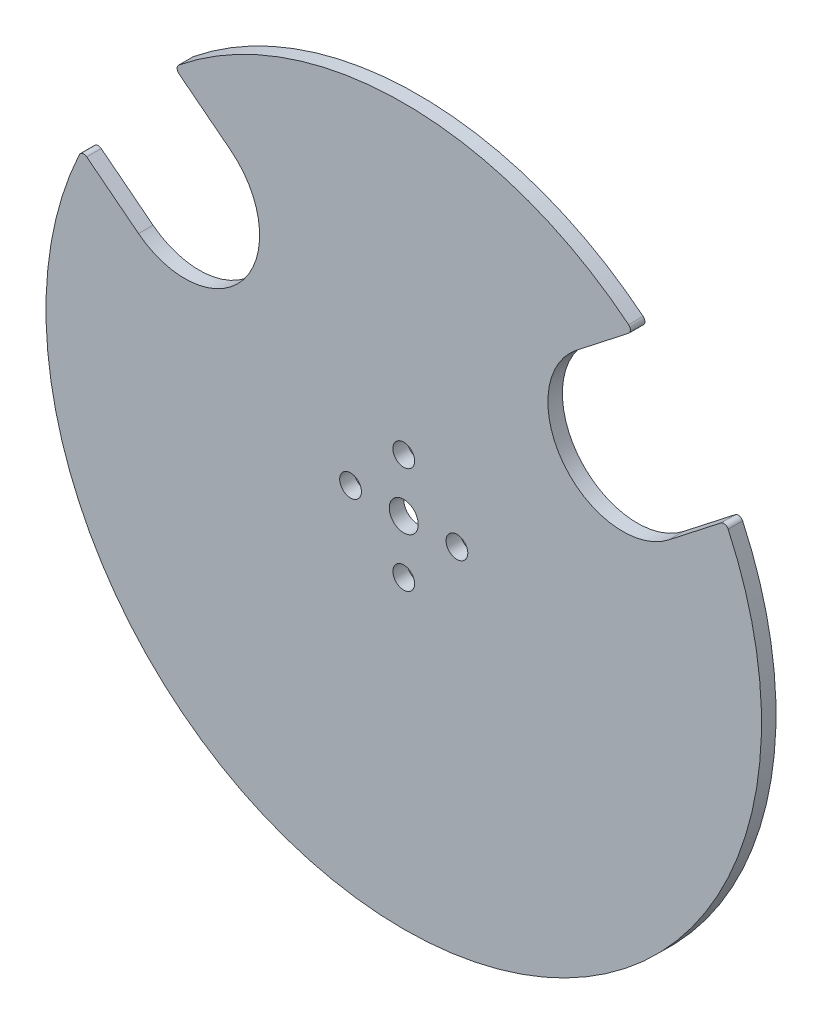
ISO-10303-21;
HEADER;
FILE_DESCRIPTION(('STEP AP214'),'2;1');
FILE_NAME('part.step','',(''),(''),'','','');
FILE_SCHEMA(('AUTOMOTIVE_DESIGN { 1 0 10303 214 1 1 1 1 }'));
ENDSEC;
DATA;
#1=APPLICATION_CONTEXT('core data for automotive mechanical design processes');
#2=APPLICATION_PROTOCOL_DEFINITION('international standard','automotive_design',2000,#1);
#3=PRODUCT_CONTEXT('',#1,'mechanical');
#4=PRODUCT('Part','Part','',(#3));
#5=PRODUCT_RELATED_PRODUCT_CATEGORY('part','',(#4));
#6=PRODUCT_DEFINITION_FORMATION('','',#4);
#7=PRODUCT_DEFINITION_CONTEXT('part definition',#1,'design');
#8=PRODUCT_DEFINITION('design','',#6,#7);
#9=PRODUCT_DEFINITION_SHAPE('','',#8);
#10=(LENGTH_UNIT() NAMED_UNIT(*) SI_UNIT(.MILLI.,.METRE.));
#11=(NAMED_UNIT(*) PLANE_ANGLE_UNIT() SI_UNIT($,.RADIAN.));
#12=(NAMED_UNIT(*) SI_UNIT($,.STERADIAN.) SOLID_ANGLE_UNIT());
#13=UNCERTAINTY_MEASURE_WITH_UNIT(LENGTH_MEASURE(1.E-05),#10,'distance_accuracy_value','');
#14=(GEOMETRIC_REPRESENTATION_CONTEXT(3) GLOBAL_UNCERTAINTY_ASSIGNED_CONTEXT((#13)) GLOBAL_UNIT_ASSIGNED_CONTEXT((#10,
#11,#12)) REPRESENTATION_CONTEXT('',''));
#15=CARTESIAN_POINT('',(0.,0.,0.));
#16=DIRECTION('',(0.,0.,1.));
#17=DIRECTION('',(1.,0.,0.));
#18=AXIS2_PLACEMENT_3D('',#15,#16,#17);
#19=CARTESIAN_POINT('',(0.,0.,3.));
#20=DIRECTION('',(0.,0.,1.));
#21=DIRECTION('',(1.,0.,0.));
#22=AXIS2_PLACEMENT_3D('',#19,#20,#21);
#23=PLANE('',#22);
#24=CARTESIAN_POINT('',(-11.,0.,3.));
#25=DIRECTION('',(0.,0.,1.));
#26=DIRECTION('',(1.,0.,0.));
#27=AXIS2_PLACEMENT_3D('',#24,#25,#26);
#28=CIRCLE('',#27,2.25);
#29=CARTESIAN_POINT('',(-8.75,0.,3.));
#30=VERTEX_POINT('',#29);
#31=EDGE_CURVE('E350',#30,#30,#28,.T.);
#32=ORIENTED_EDGE('',*,*,#31,.F.);
#33=EDGE_LOOP('',(#32));
#34=FACE_BOUND('',#33,.T.);
#35=CARTESIAN_POINT('',(11.,0.,3.));
#36=DIRECTION('',(0.,0.,1.));
#37=DIRECTION('',(1.,0.,0.));
#38=AXIS2_PLACEMENT_3D('',#35,#36,#37);
#39=CIRCLE('',#38,2.25);
#40=CARTESIAN_POINT('',(13.25,0.,3.));
#41=VERTEX_POINT('',#40);
#42=EDGE_CURVE('E366',#41,#41,#39,.T.);
#43=ORIENTED_EDGE('',*,*,#42,.F.);
#44=EDGE_LOOP('',(#43));
#45=FACE_BOUND('',#44,.T.);
#46=DIRECTION('',(0.788010753606723,0.615661475325657,0.));
#47=VECTOR('',#46,1.);
#48=CARTESIAN_POINT('',(47.4765095131863,56.7624968129867,3.));
#49=LINE('',#48,#47);
#50=CARTESIAN_POINT('',(35.7678654648389,47.6147015121295,3.));
#51=VERTEX_POINT('',#50);
#52=CARTESIAN_POINT('',(46.4933450764279,55.9943645700547,3.));
#53=VERTEX_POINT('',#52);
#54=EDGE_CURVE('E162',#51,#53,#49,.T.);
#55=ORIENTED_EDGE('',*,*,#54,.T.);
#56=CARTESIAN_POINT('',(45.8776836011022,56.7823753236614,3.));
#57=DIRECTION('',(0.,0.,1.));
#58=DIRECTION('',(1.,0.,0.));
#59=AXIS2_PLACEMENT_3D('',#56,#57,#58);
#60=CIRCLE('',#59,1.);
#61=CARTESIAN_POINT('',(46.5061450202954,57.5602160815198,3.));
#62=VERTEX_POINT('',#61);
#63=EDGE_CURVE('E245',#53,#62,#60,.T.);
#64=ORIENTED_EDGE('',*,*,#63,.T.);
#65=CARTESIAN_POINT('',(0.,0.,3.));
#66=DIRECTION('',(0.,0.,1.));
#67=DIRECTION('',(1.,0.,0.));
#68=AXIS2_PLACEMENT_3D('',#65,#66,#67);
#69=CIRCLE('',#68,74.);
#70=CARTESIAN_POINT('',(-46.5061450202954,57.5602160815198,3.));
#71=VERTEX_POINT('',#70);
#72=EDGE_CURVE('E165',#62,#71,#69,.T.);
#73=ORIENTED_EDGE('',*,*,#72,.T.);
#74=CARTESIAN_POINT('',(-45.8776836011022,56.7823753236614,3.));
#75=DIRECTION('',(0.,0.,1.));
#76=DIRECTION('',(1.,0.,0.));
#77=AXIS2_PLACEMENT_3D('',#74,#75,#76);
#78=CIRCLE('',#77,1.);
#79=CARTESIAN_POINT('',(-46.4933450764279,55.9943645700547,3.));
#80=VERTEX_POINT('',#79);
#81=EDGE_CURVE('E64',#71,#80,#78,.T.);
#82=ORIENTED_EDGE('',*,*,#81,.T.);
#83=DIRECTION('',(0.788010753606723,-0.615661475325657,0.));
#84=VECTOR('',#83,1.);
#85=CARTESIAN_POINT('',(-47.4765095131863,56.7624968129867,3.));
#86=LINE('',#85,#84);
#87=CARTESIAN_POINT('',(-35.7678654648389,47.6147015121295,3.));
#88=VERTEX_POINT('',#87);
#89=EDGE_CURVE('E171',#80,#88,#86,.T.);
#90=ORIENTED_EDGE('',*,*,#89,.T.);
#91=CARTESIAN_POINT('',(-45.3106183323866,35.4005348312252,3.));
#92=DIRECTION('',(0.,0.,-1.));
#93=DIRECTION('',(1.,0.,0.));
#94=AXIS2_PLACEMENT_3D('',#91,#92,#93);
#95=CIRCLE('',#94,15.5);
#96=CARTESIAN_POINT('',(-54.8533711999343,23.186368150321,3.));
#97=VERTEX_POINT('',#96);
#98=EDGE_CURVE('E174',#88,#97,#95,.T.);
#99=ORIENTED_EDGE('',*,*,#98,.T.);
#100=DIRECTION('',(-0.788010753606722,0.615661475325658,0.));
#101=VECTOR('',#100,1.);
#102=CARTESIAN_POINT('',(-66.5620152482817,32.3341634511783,3.));
#103=LINE('',#102,#101);
#104=CARTESIAN_POINT('',(-65.5788508115232,31.5660312082463,3.));
#105=VERTEX_POINT('',#104);
#106=EDGE_CURVE('E177',#97,#105,#103,.T.);
#107=ORIENTED_EDGE('',*,*,#106,.T.);
#108=CARTESIAN_POINT('',(-66.1945122868489,30.7780204546396,3.));
#109=DIRECTION('',(0.,0.,1.));
#110=DIRECTION('',(1.,0.,0.));
#111=AXIS2_PLACEMENT_3D('',#108,#109,#110);
#112=CIRCLE('',#111,1.);
#113=CARTESIAN_POINT('',(-67.1012864277646,31.1996371731963,3.));
#114=VERTEX_POINT('',#113);
#115=EDGE_CURVE('E240',#105,#114,#112,.T.);
#116=ORIENTED_EDGE('',*,*,#115,.T.);
#117=CARTESIAN_POINT('',(0.,0.,3.));
#118=DIRECTION('',(0.,0.,1.));
#119=DIRECTION('',(1.,0.,0.));
#120=AXIS2_PLACEMENT_3D('',#117,#118,#119);
#121=CIRCLE('',#120,74.);
#122=CARTESIAN_POINT('',(67.1012864277646,31.1996371731963,3.));
#123=VERTEX_POINT('',#122);
#124=EDGE_CURVE('E145',#114,#123,#121,.T.);
#125=ORIENTED_EDGE('',*,*,#124,.T.);
#126=CARTESIAN_POINT('',(66.1945122868489,30.7780204546396,3.));
#127=DIRECTION('',(0.,0.,1.));
#128=DIRECTION('',(1.,0.,0.));
#129=AXIS2_PLACEMENT_3D('',#126,#127,#128);
#130=CIRCLE('',#129,1.);
#131=CARTESIAN_POINT('',(65.5788508115232,31.5660312082463,3.));
#132=VERTEX_POINT('',#131);
#133=EDGE_CURVE('E140',#123,#132,#130,.T.);
#134=ORIENTED_EDGE('',*,*,#133,.T.);
#135=DIRECTION('',(-0.788010753606722,-0.615661475325658,0.));
#136=VECTOR('',#135,1.);
#137=CARTESIAN_POINT('',(66.5620152482817,32.3341634511783,3.));
#138=LINE('',#137,#136);
#139=CARTESIAN_POINT('',(54.8533711999343,23.186368150321,3.));
#140=VERTEX_POINT('',#139);
#141=EDGE_CURVE('E131',#132,#140,#138,.T.);
#142=ORIENTED_EDGE('',*,*,#141,.T.);
#143=CARTESIAN_POINT('',(45.3106183323866,35.4005348312252,3.));
#144=DIRECTION('',(0.,0.,-1.));
#145=DIRECTION('',(-1.,0.,0.));
#146=AXIS2_PLACEMENT_3D('',#143,#144,#145);
#147=CIRCLE('',#146,15.5);
#148=EDGE_CURVE('E136',#140,#51,#147,.T.);
#149=ORIENTED_EDGE('',*,*,#148,.T.);
#150=EDGE_LOOP('',(#55,#64,#73,#82,#90,#99,#107,#116,#125,#134,#142,#149));
#151=FACE_BOUND('',#150,.T.);
#152=CARTESIAN_POINT('',(0.,11.,3.));
#153=DIRECTION('',(0.,0.,1.));
#154=DIRECTION('',(1.,0.,0.));
#155=AXIS2_PLACEMENT_3D('',#152,#153,#154);
#156=CIRCLE('',#155,2.25);
#157=CARTESIAN_POINT('',(2.25,11.,3.));
#158=VERTEX_POINT('',#157);
#159=EDGE_CURVE('E185',#158,#158,#156,.T.);
#160=ORIENTED_EDGE('',*,*,#159,.F.);
#161=EDGE_LOOP('',(#160));
#162=FACE_BOUND('',#161,.T.);
#163=CARTESIAN_POINT('',(0.,-11.,3.));
#164=DIRECTION('',(0.,0.,1.));
#165=DIRECTION('',(1.,0.,0.));
#166=AXIS2_PLACEMENT_3D('',#163,#164,#165);
#167=CIRCLE('',#166,2.25);
#168=CARTESIAN_POINT('',(2.25,-11.,3.));
#169=VERTEX_POINT('',#168);
#170=EDGE_CURVE('E358',#169,#169,#167,.T.);
#171=ORIENTED_EDGE('',*,*,#170,.F.);
#172=EDGE_LOOP('',(#171));
#173=FACE_BOUND('',#172,.T.);
#174=CARTESIAN_POINT('',(0.,0.,3.));
#175=DIRECTION('',(0.,0.,1.));
#176=DIRECTION('',(1.,0.,0.));
#177=AXIS2_PLACEMENT_3D('',#174,#175,#176);
#178=CIRCLE('',#177,3.);
#179=CARTESIAN_POINT('',(3.,0.,3.));
#180=VERTEX_POINT('',#179);
#181=EDGE_CURVE('E339',#180,#180,#178,.T.);
#182=ORIENTED_EDGE('',*,*,#181,.F.);
#183=EDGE_LOOP('',(#182));
#184=FACE_BOUND('',#183,.T.);
#185=ADVANCED_FACE('F41',(#34,#45,#151,#162,#173,#184),#23,.T.);
#186=CARTESIAN_POINT('',(0.,0.,0.));
#187=DIRECTION('',(0.,0.,1.));
#188=DIRECTION('',(1.,0.,0.));
#189=AXIS2_PLACEMENT_3D('',#186,#187,#188);
#190=PLANE('',#189);
#191=CARTESIAN_POINT('',(0.,0.,0.));
#192=DIRECTION('',(0.,0.,1.));
#193=DIRECTION('',(1.,0.,0.));
#194=AXIS2_PLACEMENT_3D('',#191,#192,#193);
#195=CIRCLE('',#194,74.);
#196=CARTESIAN_POINT('',(46.5061450202954,57.5602160815198,0.));
#197=VERTEX_POINT('',#196);
#198=CARTESIAN_POINT('',(-46.5061450202954,57.5602160815198,0.));
#199=VERTEX_POINT('',#198);
#200=EDGE_CURVE('E195',#197,#199,#195,.T.);
#201=ORIENTED_EDGE('',*,*,#200,.F.);
#202=CARTESIAN_POINT('',(45.8776836011022,56.7823753236614,0.));
#203=DIRECTION('',(0.,0.,1.));
#204=DIRECTION('',(1.,0.,0.));
#205=AXIS2_PLACEMENT_3D('',#202,#203,#204);
#206=CIRCLE('',#205,1.);
#207=CARTESIAN_POINT('',(46.4933450764279,55.9943645700547,0.));
#208=VERTEX_POINT('',#207);
#209=EDGE_CURVE('E232',#197,#208,#206,.F.);
#210=ORIENTED_EDGE('',*,*,#209,.T.);
#211=DIRECTION('',(0.788010753606723,0.615661475325657,0.));
#212=VECTOR('',#211,1.);
#213=CARTESIAN_POINT('',(47.4765095131863,56.7624968129867,0.));
#214=LINE('',#213,#212);
#215=CARTESIAN_POINT('',(35.7678654648389,47.6147015121295,0.));
#216=VERTEX_POINT('',#215);
#217=EDGE_CURVE('E191',#216,#208,#214,.T.);
#218=ORIENTED_EDGE('',*,*,#217,.F.);
#219=CARTESIAN_POINT('',(45.3106183323866,35.4005348312252,0.));
#220=DIRECTION('',(0.,0.,-1.));
#221=DIRECTION('',(-1.,0.,0.));
#222=AXIS2_PLACEMENT_3D('',#219,#220,#221);
#223=CIRCLE('',#222,15.5);
#224=CARTESIAN_POINT('',(54.8533711999343,23.186368150321,0.));
#225=VERTEX_POINT('',#224);
#226=EDGE_CURVE('E188',#225,#216,#223,.T.);
#227=ORIENTED_EDGE('',*,*,#226,.F.);
#228=DIRECTION('',(-0.788010753606722,-0.615661475325658,0.));
#229=VECTOR('',#228,1.);
#230=CARTESIAN_POINT('',(66.5620152482817,32.3341634511783,0.));
#231=LINE('',#230,#229);
#232=CARTESIAN_POINT('',(65.5788508115232,31.5660312082463,0.));
#233=VERTEX_POINT('',#232);
#234=EDGE_CURVE('E151',#233,#225,#231,.T.);
#235=ORIENTED_EDGE('',*,*,#234,.F.);
#236=CARTESIAN_POINT('',(66.1945122868489,30.7780204546396,0.));
#237=DIRECTION('',(0.,0.,1.));
#238=DIRECTION('',(1.,0.,0.));
#239=AXIS2_PLACEMENT_3D('',#236,#237,#238);
#240=CIRCLE('',#239,1.);
#241=CARTESIAN_POINT('',(67.1012864277646,31.1996371731963,0.));
#242=VERTEX_POINT('',#241);
#243=EDGE_CURVE('E229',#233,#242,#240,.F.);
#244=ORIENTED_EDGE('',*,*,#243,.T.);
#245=CARTESIAN_POINT('',(0.,0.,0.));
#246=DIRECTION('',(0.,0.,1.));
#247=DIRECTION('',(1.,0.,0.));
#248=AXIS2_PLACEMENT_3D('',#245,#246,#247);
#249=CIRCLE('',#248,74.);
#250=CARTESIAN_POINT('',(-67.1012864277646,31.1996371731963,0.));
#251=VERTEX_POINT('',#250);
#252=EDGE_CURVE('E181',#251,#242,#249,.T.);
#253=ORIENTED_EDGE('',*,*,#252,.F.);
#254=CARTESIAN_POINT('',(-66.1945122868489,30.7780204546396,0.));
#255=DIRECTION('',(0.,0.,1.));
#256=DIRECTION('',(1.,0.,0.));
#257=AXIS2_PLACEMENT_3D('',#254,#255,#256);
#258=CIRCLE('',#257,1.);
#259=CARTESIAN_POINT('',(-65.5788508115232,31.5660312082463,0.));
#260=VERTEX_POINT('',#259);
#261=EDGE_CURVE('E226',#251,#260,#258,.F.);
#262=ORIENTED_EDGE('',*,*,#261,.T.);
#263=DIRECTION('',(-0.788010753606722,0.615661475325658,0.));
#264=VECTOR('',#263,1.);
#265=CARTESIAN_POINT('',(-66.5620152482817,32.3341634511783,0.));
#266=LINE('',#265,#264);
#267=CARTESIAN_POINT('',(-54.8533711999343,23.186368150321,0.));
#268=VERTEX_POINT('',#267);
#269=EDGE_CURVE('E205',#268,#260,#266,.T.);
#270=ORIENTED_EDGE('',*,*,#269,.F.);
#271=CARTESIAN_POINT('',(-45.3106183323866,35.4005348312252,0.));
#272=DIRECTION('',(0.,0.,-1.));
#273=DIRECTION('',(1.,0.,0.));
#274=AXIS2_PLACEMENT_3D('',#271,#272,#273);
#275=CIRCLE('',#274,15.5);
#276=CARTESIAN_POINT('',(-35.7678654648389,47.6147015121295,0.));
#277=VERTEX_POINT('',#276);
#278=EDGE_CURVE('E202',#277,#268,#275,.T.);
#279=ORIENTED_EDGE('',*,*,#278,.F.);
#280=DIRECTION('',(0.788010753606723,-0.615661475325657,0.));
#281=VECTOR('',#280,1.);
#282=CARTESIAN_POINT('',(-47.4765095131863,56.7624968129867,0.));
#283=LINE('',#282,#281);
#284=CARTESIAN_POINT('',(-46.4933450764279,55.9943645700547,0.));
#285=VERTEX_POINT('',#284);
#286=EDGE_CURVE('E199',#285,#277,#283,.T.);
#287=ORIENTED_EDGE('',*,*,#286,.F.);
#288=CARTESIAN_POINT('',(-45.8776836011022,56.7823753236614,0.));
#289=DIRECTION('',(0.,0.,1.));
#290=DIRECTION('',(1.,0.,0.));
#291=AXIS2_PLACEMENT_3D('',#288,#289,#290);
#292=CIRCLE('',#291,1.);
#293=EDGE_CURVE('E223',#285,#199,#292,.F.);
#294=ORIENTED_EDGE('',*,*,#293,.T.);
#295=EDGE_LOOP('',(#201,#210,#218,#227,#235,#244,#253,#262,#270,#279,#287,#294));
#296=FACE_BOUND('',#295,.T.);
#297=CARTESIAN_POINT('',(0.,11.,0.));
#298=DIRECTION('',(0.,0.,1.));
#299=DIRECTION('',(1.,0.,0.));
#300=AXIS2_PLACEMENT_3D('',#297,#298,#299);
#301=CIRCLE('',#300,2.25);
#302=CARTESIAN_POINT('',(2.25,11.,0.));
#303=VERTEX_POINT('',#302);
#304=EDGE_CURVE('E370',#303,#303,#301,.T.);
#305=ORIENTED_EDGE('',*,*,#304,.T.);
#306=EDGE_LOOP('',(#305));
#307=FACE_BOUND('',#306,.T.);
#308=CARTESIAN_POINT('',(11.,0.,0.));
#309=DIRECTION('',(0.,0.,1.));
#310=DIRECTION('',(1.,0.,0.));
#311=AXIS2_PLACEMENT_3D('',#308,#309,#310);
#312=CIRCLE('',#311,2.25);
#313=CARTESIAN_POINT('',(13.25,0.,0.));
#314=VERTEX_POINT('',#313);
#315=EDGE_CURVE('E362',#314,#314,#312,.T.);
#316=ORIENTED_EDGE('',*,*,#315,.T.);
#317=EDGE_LOOP('',(#316));
#318=FACE_BOUND('',#317,.T.);
#319=CARTESIAN_POINT('',(0.,-11.,0.));
#320=DIRECTION('',(0.,0.,1.));
#321=DIRECTION('',(1.,0.,0.));
#322=AXIS2_PLACEMENT_3D('',#319,#320,#321);
#323=CIRCLE('',#322,2.25);
#324=CARTESIAN_POINT('',(2.25,-11.,0.));
#325=VERTEX_POINT('',#324);
#326=EDGE_CURVE('E354',#325,#325,#323,.T.);
#327=ORIENTED_EDGE('',*,*,#326,.T.);
#328=EDGE_LOOP('',(#327));
#329=FACE_BOUND('',#328,.T.);
#330=CARTESIAN_POINT('',(-11.,0.,0.));
#331=DIRECTION('',(0.,0.,1.));
#332=DIRECTION('',(1.,0.,0.));
#333=AXIS2_PLACEMENT_3D('',#330,#331,#332);
#334=CIRCLE('',#333,2.25);
#335=CARTESIAN_POINT('',(-8.75,0.,0.));
#336=VERTEX_POINT('',#335);
#337=EDGE_CURVE('E347',#336,#336,#334,.T.);
#338=ORIENTED_EDGE('',*,*,#337,.T.);
#339=EDGE_LOOP('',(#338));
#340=FACE_BOUND('',#339,.T.);
#341=CARTESIAN_POINT('',(0.,0.,0.));
#342=DIRECTION('',(0.,0.,1.));
#343=DIRECTION('',(1.,0.,0.));
#344=AXIS2_PLACEMENT_3D('',#341,#342,#343);
#345=CIRCLE('',#344,3.);
#346=CARTESIAN_POINT('',(3.,0.,0.));
#347=VERTEX_POINT('',#346);
#348=EDGE_CURVE('E342',#347,#347,#345,.T.);
#349=ORIENTED_EDGE('',*,*,#348,.T.);
#350=EDGE_LOOP('',(#349));
#351=FACE_BOUND('',#350,.T.);
#352=ADVANCED_FACE('F270',(#296,#307,#318,#329,#340,#351),#190,.F.);
#353=CARTESIAN_POINT('',(0.,0.,3.));
#354=DIRECTION('',(0.,0.,-1.));
#355=DIRECTION('',(-1.,0.,0.));
#356=AXIS2_PLACEMENT_3D('',#353,#354,#355);
#357=CYLINDRICAL_SURFACE('',#356,74.);
#358=ORIENTED_EDGE('',*,*,#252,.T.);
#359=DIRECTION('',(0.,0.,-1.));
#360=VECTOR('',#359,1.);
#361=CARTESIAN_POINT('',(67.1012864277646,31.1996371731963,3.));
#362=LINE('',#361,#360);
#363=EDGE_CURVE('E255',#242,#123,#362,.F.);
#364=ORIENTED_EDGE('',*,*,#363,.T.);
#365=ORIENTED_EDGE('',*,*,#124,.F.);
#366=DIRECTION('',(0.,0.,-1.));
#367=VECTOR('',#366,1.);
#368=CARTESIAN_POINT('',(-67.1012864277646,31.1996371731963,3.));
#369=LINE('',#368,#367);
#370=EDGE_CURVE('E251',#114,#251,#369,.T.);
#371=ORIENTED_EDGE('',*,*,#370,.T.);
#372=EDGE_LOOP('',(#358,#364,#365,#371));
#373=FACE_BOUND('',#372,.T.);
#374=ADVANCED_FACE('F261',(#373),#357,.T.);
#375=CARTESIAN_POINT('',(66.5620152482817,32.3341634511783,3.));
#376=DIRECTION('',(0.615661475325658,-0.788010753606722,0.));
#377=DIRECTION('',(0.788010753606722,0.615661475325658,0.));
#378=AXIS2_PLACEMENT_3D('',#375,#376,#377);
#379=PLANE('',#378);
#380=ORIENTED_EDGE('',*,*,#141,.F.);
#381=DIRECTION('',(0.,0.,-1.));
#382=VECTOR('',#381,1.);
#383=CARTESIAN_POINT('',(65.5788508115232,31.5660312082463,3.));
#384=LINE('',#383,#382);
#385=EDGE_CURVE('E248',#132,#233,#384,.T.);
#386=ORIENTED_EDGE('',*,*,#385,.T.);
#387=ORIENTED_EDGE('',*,*,#234,.T.);
#388=DIRECTION('',(0.,0.,-1.));
#389=VECTOR('',#388,1.);
#390=CARTESIAN_POINT('',(54.8533711999343,23.186368150321,3.));
#391=LINE('',#390,#389);
#392=EDGE_CURVE('E148',#140,#225,#391,.T.);
#393=ORIENTED_EDGE('',*,*,#392,.F.);
#394=EDGE_LOOP('',(#380,#386,#387,#393));
#395=FACE_BOUND('',#394,.T.);
#396=ADVANCED_FACE('F149',(#395),#379,.F.);
#397=CARTESIAN_POINT('',(45.3106183323866,35.4005348312252,3.));
#398=DIRECTION('',(0.,0.,-1.));
#399=DIRECTION('',(-1.,0.,0.));
#400=AXIS2_PLACEMENT_3D('',#397,#398,#399);
#401=CYLINDRICAL_SURFACE('',#400,15.5);
#402=ORIENTED_EDGE('',*,*,#226,.T.);
#403=DIRECTION('',(0.,0.,-1.));
#404=VECTOR('',#403,1.);
#405=CARTESIAN_POINT('',(35.7678654648389,47.6147015121295,3.));
#406=LINE('',#405,#404);
#407=EDGE_CURVE('E156',#51,#216,#406,.T.);
#408=ORIENTED_EDGE('',*,*,#407,.F.);
#409=ORIENTED_EDGE('',*,*,#148,.F.);
#410=ORIENTED_EDGE('',*,*,#392,.T.);
#411=EDGE_LOOP('',(#402,#408,#409,#410));
#412=FACE_BOUND('',#411,.T.);
#413=ADVANCED_FACE('F158',(#412),#401,.F.);
#414=CARTESIAN_POINT('',(47.4765095131863,56.7624968129867,3.));
#415=DIRECTION('',(-0.615661475325657,0.788010753606723,0.));
#416=DIRECTION('',(-0.788010753606723,-0.615661475325657,0.));
#417=AXIS2_PLACEMENT_3D('',#414,#415,#416);
#418=PLANE('',#417);
#419=ORIENTED_EDGE('',*,*,#217,.T.);
#420=DIRECTION('',(0.,0.,-1.));
#421=VECTOR('',#420,1.);
#422=CARTESIAN_POINT('',(46.4933450764279,55.9943645700547,3.));
#423=LINE('',#422,#421);
#424=EDGE_CURVE('E235',#208,#53,#423,.F.);
#425=ORIENTED_EDGE('',*,*,#424,.T.);
#426=ORIENTED_EDGE('',*,*,#54,.F.);
#427=ORIENTED_EDGE('',*,*,#407,.T.);
#428=EDGE_LOOP('',(#419,#425,#426,#427));
#429=FACE_BOUND('',#428,.T.);
#430=ADVANCED_FACE('F274',(#429),#418,.F.);
#431=CARTESIAN_POINT('',(0.,0.,3.));
#432=DIRECTION('',(0.,0.,-1.));
#433=DIRECTION('',(-1.,0.,0.));
#434=AXIS2_PLACEMENT_3D('',#431,#432,#433);
#435=CYLINDRICAL_SURFACE('',#434,74.);
#436=ORIENTED_EDGE('',*,*,#72,.F.);
#437=DIRECTION('',(0.,0.,-1.));
#438=VECTOR('',#437,1.);
#439=CARTESIAN_POINT('',(46.5061450202954,57.5602160815198,3.));
#440=LINE('',#439,#438);
#441=EDGE_CURVE('E219',#62,#197,#440,.T.);
#442=ORIENTED_EDGE('',*,*,#441,.T.);
#443=ORIENTED_EDGE('',*,*,#200,.T.);
#444=DIRECTION('',(0.,0.,-1.));
#445=VECTOR('',#444,1.);
#446=CARTESIAN_POINT('',(-46.5061450202954,57.5602160815198,3.));
#447=LINE('',#446,#445);
#448=EDGE_CURVE('E155',#199,#71,#447,.F.);
#449=ORIENTED_EDGE('',*,*,#448,.T.);
#450=EDGE_LOOP('',(#436,#442,#443,#449));
#451=FACE_BOUND('',#450,.T.);
#452=ADVANCED_FACE('F282',(#451),#435,.T.);
#453=CARTESIAN_POINT('',(-47.4765095131863,56.7624968129867,3.));
#454=DIRECTION('',(0.615661475325657,0.788010753606723,0.));
#455=DIRECTION('',(-0.788010753606723,0.615661475325657,0.));
#456=AXIS2_PLACEMENT_3D('',#453,#454,#455);
#457=PLANE('',#456);
#458=ORIENTED_EDGE('',*,*,#89,.F.);
#459=DIRECTION('',(0.,0.,-1.));
#460=VECTOR('',#459,1.);
#461=CARTESIAN_POINT('',(-46.4933450764279,55.9943645700547,3.));
#462=LINE('',#461,#460);
#463=EDGE_CURVE('E11',#80,#285,#462,.T.);
#464=ORIENTED_EDGE('',*,*,#463,.T.);
#465=ORIENTED_EDGE('',*,*,#286,.T.);
#466=DIRECTION('',(0.,0.,-1.));
#467=VECTOR('',#466,1.);
#468=CARTESIAN_POINT('',(-35.7678654648389,47.6147015121295,3.));
#469=LINE('',#468,#467);
#470=EDGE_CURVE('E211',#88,#277,#469,.T.);
#471=ORIENTED_EDGE('',*,*,#470,.F.);
#472=EDGE_LOOP('',(#458,#464,#465,#471));
#473=FACE_BOUND('',#472,.T.);
#474=ADVANCED_FACE('F289',(#473),#457,.F.);
#475=CARTESIAN_POINT('',(-45.3106183323866,35.4005348312252,3.));
#476=DIRECTION('',(0.,0.,-1.));
#477=DIRECTION('',(-1.,0.,0.));
#478=AXIS2_PLACEMENT_3D('',#475,#476,#477);
#479=CYLINDRICAL_SURFACE('',#478,15.5);
#480=ORIENTED_EDGE('',*,*,#278,.T.);
#481=DIRECTION('',(0.,0.,-1.));
#482=VECTOR('',#481,1.);
#483=CARTESIAN_POINT('',(-54.8533711999343,23.186368150321,3.));
#484=LINE('',#483,#482);
#485=EDGE_CURVE('E180',#97,#268,#484,.T.);
#486=ORIENTED_EDGE('',*,*,#485,.F.);
#487=ORIENTED_EDGE('',*,*,#98,.F.);
#488=ORIENTED_EDGE('',*,*,#470,.T.);
#489=EDGE_LOOP('',(#480,#486,#487,#488));
#490=FACE_BOUND('',#489,.T.);
#491=ADVANCED_FACE('F294',(#490),#479,.F.);
#492=CARTESIAN_POINT('',(-66.5620152482817,32.3341634511783,3.));
#493=DIRECTION('',(-0.615661475325658,-0.788010753606722,0.));
#494=DIRECTION('',(0.788010753606722,-0.615661475325658,0.));
#495=AXIS2_PLACEMENT_3D('',#492,#493,#494);
#496=PLANE('',#495);
#497=ORIENTED_EDGE('',*,*,#269,.T.);
#498=DIRECTION('',(0.,0.,-1.));
#499=VECTOR('',#498,1.);
#500=CARTESIAN_POINT('',(-65.5788508115232,31.5660312082463,3.));
#501=LINE('',#500,#499);
#502=EDGE_CURVE('E50',#260,#105,#501,.F.);
#503=ORIENTED_EDGE('',*,*,#502,.T.);
#504=ORIENTED_EDGE('',*,*,#106,.F.);
#505=ORIENTED_EDGE('',*,*,#485,.T.);
#506=EDGE_LOOP('',(#497,#503,#504,#505));
#507=FACE_BOUND('',#506,.T.);
#508=ADVANCED_FACE('F296',(#507),#496,.F.);
#509=CARTESIAN_POINT('',(0.,11.,3.));
#510=DIRECTION('',(0.,0.,-1.));
#511=DIRECTION('',(-1.,0.,0.));
#512=AXIS2_PLACEMENT_3D('',#509,#510,#511);
#513=CYLINDRICAL_SURFACE('',#512,2.25);
#514=ORIENTED_EDGE('',*,*,#159,.T.);
#515=EDGE_LOOP('',(#514));
#516=FACE_BOUND('',#515,.T.);
#517=ORIENTED_EDGE('',*,*,#304,.F.);
#518=EDGE_LOOP('',(#517));
#519=FACE_BOUND('',#518,.T.);
#520=ADVANCED_FACE('F298',(#516,#519),#513,.F.);
#521=CARTESIAN_POINT('',(11.,0.,3.));
#522=DIRECTION('',(0.,0.,-1.));
#523=DIRECTION('',(-1.,0.,0.));
#524=AXIS2_PLACEMENT_3D('',#521,#522,#523);
#525=CYLINDRICAL_SURFACE('',#524,2.25);
#526=ORIENTED_EDGE('',*,*,#42,.T.);
#527=EDGE_LOOP('',(#526));
#528=FACE_BOUND('',#527,.T.);
#529=ORIENTED_EDGE('',*,*,#315,.F.);
#530=EDGE_LOOP('',(#529));
#531=FACE_BOUND('',#530,.T.);
#532=ADVANCED_FACE('F304',(#528,#531),#525,.F.);
#533=CARTESIAN_POINT('',(0.,-11.,3.));
#534=DIRECTION('',(0.,0.,-1.));
#535=DIRECTION('',(-1.,0.,0.));
#536=AXIS2_PLACEMENT_3D('',#533,#534,#535);
#537=CYLINDRICAL_SURFACE('',#536,2.25);
#538=ORIENTED_EDGE('',*,*,#170,.T.);
#539=EDGE_LOOP('',(#538));
#540=FACE_BOUND('',#539,.T.);
#541=ORIENTED_EDGE('',*,*,#326,.F.);
#542=EDGE_LOOP('',(#541));
#543=FACE_BOUND('',#542,.T.);
#544=ADVANCED_FACE('F320',(#540,#543),#537,.F.);
#545=CARTESIAN_POINT('',(-11.,0.,3.));
#546=DIRECTION('',(0.,0.,-1.));
#547=DIRECTION('',(-1.,0.,0.));
#548=AXIS2_PLACEMENT_3D('',#545,#546,#547);
#549=CYLINDRICAL_SURFACE('',#548,2.25);
#550=ORIENTED_EDGE('',*,*,#31,.T.);
#551=EDGE_LOOP('',(#550));
#552=FACE_BOUND('',#551,.T.);
#553=ORIENTED_EDGE('',*,*,#337,.F.);
#554=EDGE_LOOP('',(#553));
#555=FACE_BOUND('',#554,.T.);
#556=ADVANCED_FACE('F324',(#552,#555),#549,.F.);
#557=CARTESIAN_POINT('',(0.,0.,3.));
#558=DIRECTION('',(0.,0.,-1.));
#559=DIRECTION('',(-1.,0.,0.));
#560=AXIS2_PLACEMENT_3D('',#557,#558,#559);
#561=CYLINDRICAL_SURFACE('',#560,3.);
#562=ORIENTED_EDGE('',*,*,#181,.T.);
#563=EDGE_LOOP('',(#562));
#564=FACE_BOUND('',#563,.T.);
#565=ORIENTED_EDGE('',*,*,#348,.F.);
#566=EDGE_LOOP('',(#565));
#567=FACE_BOUND('',#566,.T.);
#568=ADVANCED_FACE('F328',(#564,#567),#561,.F.);
#569=CARTESIAN_POINT('',(45.8776836011022,56.7823753236614,3.));
#570=DIRECTION('',(0.,0.,-1.));
#571=DIRECTION('',(-1.,0.,0.));
#572=AXIS2_PLACEMENT_3D('',#569,#570,#571);
#573=CYLINDRICAL_SURFACE('',#572,1.);
#574=ORIENTED_EDGE('',*,*,#63,.F.);
#575=ORIENTED_EDGE('',*,*,#424,.F.);
#576=ORIENTED_EDGE('',*,*,#209,.F.);
#577=ORIENTED_EDGE('',*,*,#441,.F.);
#578=EDGE_LOOP('',(#574,#575,#576,#577));
#579=FACE_BOUND('',#578,.T.);
#580=ADVANCED_FACE('F280',(#579),#573,.T.);
#581=CARTESIAN_POINT('',(66.1945122868489,30.7780204546396,3.));
#582=DIRECTION('',(0.,0.,-1.));
#583=DIRECTION('',(-1.,0.,0.));
#584=AXIS2_PLACEMENT_3D('',#581,#582,#583);
#585=CYLINDRICAL_SURFACE('',#584,1.);
#586=ORIENTED_EDGE('',*,*,#133,.F.);
#587=ORIENTED_EDGE('',*,*,#363,.F.);
#588=ORIENTED_EDGE('',*,*,#243,.F.);
#589=ORIENTED_EDGE('',*,*,#385,.F.);
#590=EDGE_LOOP('',(#586,#587,#588,#589));
#591=FACE_BOUND('',#590,.T.);
#592=ADVANCED_FACE('F267',(#591),#585,.T.);
#593=CARTESIAN_POINT('',(-66.1945122868489,30.7780204546396,3.));
#594=DIRECTION('',(0.,0.,-1.));
#595=DIRECTION('',(-1.,0.,0.));
#596=AXIS2_PLACEMENT_3D('',#593,#594,#595);
#597=CYLINDRICAL_SURFACE('',#596,1.);
#598=ORIENTED_EDGE('',*,*,#115,.F.);
#599=ORIENTED_EDGE('',*,*,#502,.F.);
#600=ORIENTED_EDGE('',*,*,#261,.F.);
#601=ORIENTED_EDGE('',*,*,#370,.F.);
#602=EDGE_LOOP('',(#598,#599,#600,#601));
#603=FACE_BOUND('',#602,.T.);
#604=ADVANCED_FACE('F398',(#603),#597,.T.);
#605=CARTESIAN_POINT('',(-45.8776836011022,56.7823753236614,3.));
#606=DIRECTION('',(0.,0.,-1.));
#607=DIRECTION('',(-1.,0.,0.));
#608=AXIS2_PLACEMENT_3D('',#605,#606,#607);
#609=CYLINDRICAL_SURFACE('',#608,1.);
#610=ORIENTED_EDGE('',*,*,#81,.F.);
#611=ORIENTED_EDGE('',*,*,#448,.F.);
#612=ORIENTED_EDGE('',*,*,#293,.F.);
#613=ORIENTED_EDGE('',*,*,#463,.F.);
#614=EDGE_LOOP('',(#610,#611,#612,#613));
#615=FACE_BOUND('',#614,.T.);
#616=ADVANCED_FACE('F43',(#615),#609,.T.);
#617=CLOSED_SHELL('',(#185,#352,#374,#396,#413,#430,#452,#474,#491,#508,#520,#532,#544,#556,
#568,#580,#592,#604,#616));
#618=MANIFOLD_SOLID_BREP('B2',#617);
#619=ADVANCED_BREP_SHAPE_REPRESENTATION('',(#18,#618),#14);
#620=SHAPE_DEFINITION_REPRESENTATION(#9,#619);
ENDSEC;
END-ISO-10303-21;
